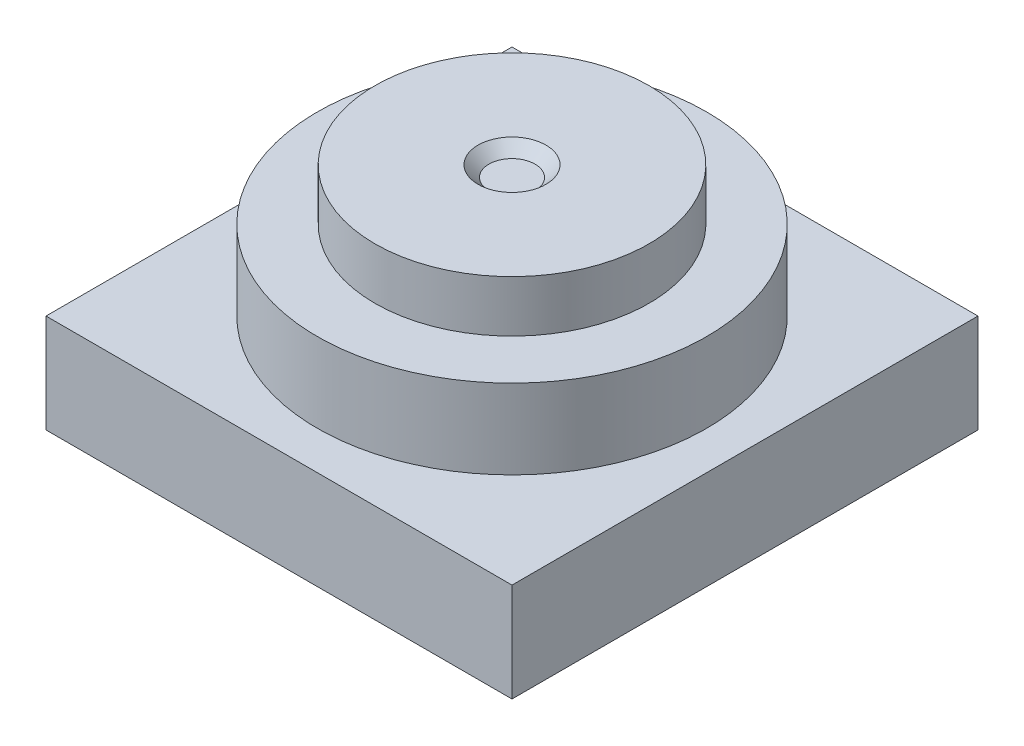
ISO-10303-21;
HEADER;
FILE_DESCRIPTION(('STEP AP214'),'2;1');
FILE_NAME('part.step','',(''),(''),'','','');
FILE_SCHEMA(('AUTOMOTIVE_DESIGN { 1 0 10303 214 1 1 1 1 }'));
ENDSEC;
DATA;
#1=APPLICATION_CONTEXT('core data for automotive mechanical design processes');
#2=APPLICATION_PROTOCOL_DEFINITION('international standard','automotive_design',2000,#1);
#3=PRODUCT_CONTEXT('',#1,'mechanical');
#4=PRODUCT('Part','Part','',(#3));
#5=PRODUCT_RELATED_PRODUCT_CATEGORY('part','',(#4));
#6=PRODUCT_DEFINITION_FORMATION('','',#4);
#7=PRODUCT_DEFINITION_CONTEXT('part definition',#1,'design');
#8=PRODUCT_DEFINITION('design','',#6,#7);
#9=PRODUCT_DEFINITION_SHAPE('','',#8);
#10=(LENGTH_UNIT() NAMED_UNIT(*) SI_UNIT(.MILLI.,.METRE.));
#11=(NAMED_UNIT(*) PLANE_ANGLE_UNIT() SI_UNIT($,.RADIAN.));
#12=(NAMED_UNIT(*) SI_UNIT($,.STERADIAN.) SOLID_ANGLE_UNIT());
#13=UNCERTAINTY_MEASURE_WITH_UNIT(LENGTH_MEASURE(1.E-05),#10,'distance_accuracy_value','');
#14=(GEOMETRIC_REPRESENTATION_CONTEXT(3) GLOBAL_UNCERTAINTY_ASSIGNED_CONTEXT((#13)) GLOBAL_UNIT_ASSIGNED_CONTEXT((#10,
#11,#12)) REPRESENTATION_CONTEXT('',''));
#15=CARTESIAN_POINT('',(0.,0.,0.));
#16=DIRECTION('',(0.,0.,1.));
#17=DIRECTION('',(1.,0.,0.));
#18=AXIS2_PLACEMENT_3D('',#15,#16,#17);
#19=CARTESIAN_POINT('',(4.25,1.8,0.));
#20=DIRECTION('',(1.,0.,0.));
#21=DIRECTION('',(0.,0.,-1.));
#22=AXIS2_PLACEMENT_3D('',#19,#20,#21);
#23=PLANE('',#22);
#24=DIRECTION('',(0.,0.,1.));
#25=VECTOR('',#24,1.);
#26=CARTESIAN_POINT('',(4.25,0.,0.));
#27=LINE('',#26,#25);
#28=CARTESIAN_POINT('',(4.25,0.,-4.25));
#29=VERTEX_POINT('',#28);
#30=CARTESIAN_POINT('',(4.25,0.,4.25));
#31=VERTEX_POINT('',#30);
#32=EDGE_CURVE('E110',#29,#31,#27,.T.);
#33=ORIENTED_EDGE('',*,*,#32,.F.);
#34=DIRECTION('',(0.,-1.,0.));
#35=VECTOR('',#34,1.);
#36=CARTESIAN_POINT('',(4.25,1.8,-4.25));
#37=LINE('',#36,#35);
#38=CARTESIAN_POINT('',(4.25,1.8,-4.25));
#39=VERTEX_POINT('',#38);
#40=EDGE_CURVE('E48',#39,#29,#37,.T.);
#41=ORIENTED_EDGE('',*,*,#40,.F.);
#42=DIRECTION('',(0.,0.,1.));
#43=VECTOR('',#42,1.);
#44=CARTESIAN_POINT('',(4.25,1.8,0.));
#45=LINE('',#44,#43);
#46=CARTESIAN_POINT('',(4.25,1.8,4.25));
#47=VERTEX_POINT('',#46);
#48=EDGE_CURVE('E103',#39,#47,#45,.T.);
#49=ORIENTED_EDGE('',*,*,#48,.T.);
#50=DIRECTION('',(0.,-1.,0.));
#51=VECTOR('',#50,1.);
#52=CARTESIAN_POINT('',(4.25,1.8,4.25));
#53=LINE('',#52,#51);
#54=EDGE_CURVE('E80',#47,#31,#53,.T.);
#55=ORIENTED_EDGE('',*,*,#54,.T.);
#56=EDGE_LOOP('',(#33,#41,#49,#55));
#57=FACE_BOUND('',#56,.T.);
#58=ADVANCED_FACE('F39',(#57),#23,.T.);
#59=CARTESIAN_POINT('',(0.,1.8,-4.25));
#60=DIRECTION('',(0.,0.,-1.));
#61=DIRECTION('',(-1.,0.,0.));
#62=AXIS2_PLACEMENT_3D('',#59,#60,#61);
#63=PLANE('',#62);
#64=DIRECTION('',(1.,0.,0.));
#65=VECTOR('',#64,1.);
#66=CARTESIAN_POINT('',(0.,0.,-4.25));
#67=LINE('',#66,#65);
#68=CARTESIAN_POINT('',(-4.25,0.,-4.25));
#69=VERTEX_POINT('',#68);
#70=EDGE_CURVE('E93',#69,#29,#67,.T.);
#71=ORIENTED_EDGE('',*,*,#70,.F.);
#72=DIRECTION('',(0.,-1.,0.));
#73=VECTOR('',#72,1.);
#74=CARTESIAN_POINT('',(-4.25,1.8,-4.25));
#75=LINE('',#74,#73);
#76=CARTESIAN_POINT('',(-4.25,1.8,-4.25));
#77=VERTEX_POINT('',#76);
#78=EDGE_CURVE('E87',#77,#69,#75,.T.);
#79=ORIENTED_EDGE('',*,*,#78,.F.);
#80=DIRECTION('',(1.,0.,0.));
#81=VECTOR('',#80,1.);
#82=CARTESIAN_POINT('',(0.,1.8,-4.25));
#83=LINE('',#82,#81);
#84=EDGE_CURVE('E91',#77,#39,#83,.T.);
#85=ORIENTED_EDGE('',*,*,#84,.T.);
#86=ORIENTED_EDGE('',*,*,#40,.T.);
#87=EDGE_LOOP('',(#71,#79,#85,#86));
#88=FACE_BOUND('',#87,.T.);
#89=ADVANCED_FACE('F89',(#88),#63,.T.);
#90=CARTESIAN_POINT('',(-4.25,1.8,0.));
#91=DIRECTION('',(1.,0.,0.));
#92=DIRECTION('',(0.,0.,-1.));
#93=AXIS2_PLACEMENT_3D('',#90,#91,#92);
#94=PLANE('',#93);
#95=DIRECTION('',(0.,0.,1.));
#96=VECTOR('',#95,1.);
#97=CARTESIAN_POINT('',(-4.25,0.,0.));
#98=LINE('',#97,#96);
#99=CARTESIAN_POINT('',(-4.25,0.,4.25));
#100=VERTEX_POINT('',#99);
#101=EDGE_CURVE('E114',#69,#100,#98,.T.);
#102=ORIENTED_EDGE('',*,*,#101,.T.);
#103=DIRECTION('',(0.,-1.,0.));
#104=VECTOR('',#103,1.);
#105=CARTESIAN_POINT('',(-4.25,1.8,4.25));
#106=LINE('',#105,#104);
#107=CARTESIAN_POINT('',(-4.25,1.8,4.25));
#108=VERTEX_POINT('',#107);
#109=EDGE_CURVE('E96',#108,#100,#106,.T.);
#110=ORIENTED_EDGE('',*,*,#109,.F.);
#111=DIRECTION('',(0.,0.,1.));
#112=VECTOR('',#111,1.);
#113=CARTESIAN_POINT('',(-4.25,1.8,0.));
#114=LINE('',#113,#112);
#115=EDGE_CURVE('E99',#77,#108,#114,.T.);
#116=ORIENTED_EDGE('',*,*,#115,.F.);
#117=ORIENTED_EDGE('',*,*,#78,.T.);
#118=EDGE_LOOP('',(#102,#110,#116,#117));
#119=FACE_BOUND('',#118,.T.);
#120=ADVANCED_FACE('F100',(#119),#94,.F.);
#121=CARTESIAN_POINT('',(0.,1.8,4.25));
#122=DIRECTION('',(0.,0.,-1.));
#123=DIRECTION('',(-1.,0.,0.));
#124=AXIS2_PLACEMENT_3D('',#121,#122,#123);
#125=PLANE('',#124);
#126=DIRECTION('',(1.,0.,0.));
#127=VECTOR('',#126,1.);
#128=CARTESIAN_POINT('',(0.,0.,4.25));
#129=LINE('',#128,#127);
#130=EDGE_CURVE('E73',#100,#31,#129,.T.);
#131=ORIENTED_EDGE('',*,*,#130,.T.);
#132=ORIENTED_EDGE('',*,*,#54,.F.);
#133=DIRECTION('',(1.,0.,0.));
#134=VECTOR('',#133,1.);
#135=CARTESIAN_POINT('',(0.,1.8,4.25));
#136=LINE('',#135,#134);
#137=EDGE_CURVE('E56',#108,#47,#136,.T.);
#138=ORIENTED_EDGE('',*,*,#137,.F.);
#139=ORIENTED_EDGE('',*,*,#109,.T.);
#140=EDGE_LOOP('',(#131,#132,#138,#139));
#141=FACE_BOUND('',#140,.T.);
#142=ADVANCED_FACE('F129',(#141),#125,.F.);
#143=CARTESIAN_POINT('',(0.,1.8,0.));
#144=DIRECTION('',(0.,1.,0.));
#145=DIRECTION('',(0.,0.,1.));
#146=AXIS2_PLACEMENT_3D('',#143,#144,#145);
#147=PLANE('',#146);
#148=CARTESIAN_POINT('',(0.,1.8,0.));
#149=DIRECTION('',(0.,1.,0.));
#150=DIRECTION('',(0.,0.,1.));
#151=AXIS2_PLACEMENT_3D('',#148,#149,#150);
#152=CIRCLE('',#151,3.55);
#153=CARTESIAN_POINT('',(0.,1.8,-3.55));
#154=VERTEX_POINT('',#153);
#155=EDGE_CURVE('E105',#154,#154,#152,.T.);
#156=ORIENTED_EDGE('',*,*,#155,.F.);
#157=EDGE_LOOP('',(#156));
#158=FACE_BOUND('',#157,.T.);
#159=ORIENTED_EDGE('',*,*,#48,.F.);
#160=ORIENTED_EDGE('',*,*,#84,.F.);
#161=ORIENTED_EDGE('',*,*,#115,.T.);
#162=ORIENTED_EDGE('',*,*,#137,.T.);
#163=EDGE_LOOP('',(#159,#160,#161,#162));
#164=FACE_BOUND('',#163,.T.);
#165=ADVANCED_FACE('F102',(#158,#164),#147,.T.);
#166=CARTESIAN_POINT('',(0.,0.,0.));
#167=DIRECTION('',(0.,1.,0.));
#168=DIRECTION('',(0.,0.,1.));
#169=AXIS2_PLACEMENT_3D('',#166,#167,#168);
#170=PLANE('',#169);
#171=ORIENTED_EDGE('',*,*,#32,.T.);
#172=ORIENTED_EDGE('',*,*,#130,.F.);
#173=ORIENTED_EDGE('',*,*,#101,.F.);
#174=ORIENTED_EDGE('',*,*,#70,.T.);
#175=EDGE_LOOP('',(#171,#172,#173,#174));
#176=FACE_BOUND('',#175,.T.);
#177=ADVANCED_FACE('F118',(#176),#170,.F.);
#178=CARTESIAN_POINT('',(0.,3.25,0.));
#179=DIRECTION('',(0.,-1.,0.));
#180=DIRECTION('',(0.,0.,-1.));
#181=AXIS2_PLACEMENT_3D('',#178,#179,#180);
#182=CYLINDRICAL_SURFACE('',#181,3.55);
#183=CARTESIAN_POINT('',(0.,3.25,0.));
#184=DIRECTION('',(0.,1.,0.));
#185=DIRECTION('',(0.,0.,1.));
#186=AXIS2_PLACEMENT_3D('',#183,#184,#185);
#187=CIRCLE('',#186,3.55);
#188=CARTESIAN_POINT('',(0.,3.25,-3.55));
#189=VERTEX_POINT('',#188);
#190=EDGE_CURVE('E112',#189,#189,#187,.T.);
#191=CARTESIAN_POINT('',(0.,1.8,-3.55));
#192=CARTESIAN_POINT('',(0.,1.81510416666667,-3.55));
#193=CARTESIAN_POINT('',(0.,1.83020833333333,-3.55));
#194=CARTESIAN_POINT('',(0.,1.86041666666667,-3.55));
#195=CARTESIAN_POINT('',(0.,1.87552083333333,-3.55));
#196=CARTESIAN_POINT('',(0.,1.90572916666667,-3.55));
#197=CARTESIAN_POINT('',(0.,1.92083333333333,-3.55));
#198=CARTESIAN_POINT('',(0.,1.95104166666667,-3.55));
#199=CARTESIAN_POINT('',(0.,1.96614583333333,-3.55));
#200=CARTESIAN_POINT('',(0.,1.99635416666667,-3.55));
#201=CARTESIAN_POINT('',(0.,2.01145833333333,-3.55));
#202=CARTESIAN_POINT('',(0.,2.04166666666667,-3.55));
#203=CARTESIAN_POINT('',(0.,2.05677083333333,-3.55));
#204=CARTESIAN_POINT('',(0.,2.08697916666667,-3.55));
#205=CARTESIAN_POINT('',(0.,2.10208333333333,-3.55));
#206=CARTESIAN_POINT('',(0.,2.13229166666667,-3.55));
#207=CARTESIAN_POINT('',(0.,2.14739583333333,-3.55));
#208=CARTESIAN_POINT('',(0.,2.17760416666667,-3.55));
#209=CARTESIAN_POINT('',(0.,2.19270833333333,-3.55));
#210=CARTESIAN_POINT('',(0.,2.22291666666667,-3.55));
#211=CARTESIAN_POINT('',(0.,2.23802083333333,-3.55));
#212=CARTESIAN_POINT('',(0.,2.26822916666667,-3.55));
#213=CARTESIAN_POINT('',(0.,2.28333333333333,-3.55));
#214=CARTESIAN_POINT('',(0.,2.31354166666667,-3.55));
#215=CARTESIAN_POINT('',(0.,2.32864583333333,-3.55));
#216=CARTESIAN_POINT('',(0.,2.35885416666667,-3.55));
#217=CARTESIAN_POINT('',(0.,2.37395833333333,-3.55));
#218=CARTESIAN_POINT('',(0.,2.40416666666667,-3.55));
#219=CARTESIAN_POINT('',(0.,2.41927083333333,-3.55));
#220=CARTESIAN_POINT('',(0.,2.44947916666667,-3.55));
#221=CARTESIAN_POINT('',(0.,2.46458333333333,-3.55));
#222=CARTESIAN_POINT('',(0.,2.49479166666667,-3.55));
#223=CARTESIAN_POINT('',(0.,2.50989583333333,-3.55));
#224=CARTESIAN_POINT('',(0.,2.54010416666667,-3.55));
#225=CARTESIAN_POINT('',(0.,2.55520833333333,-3.55));
#226=CARTESIAN_POINT('',(0.,2.58541666666667,-3.55));
#227=CARTESIAN_POINT('',(0.,2.60052083333333,-3.55));
#228=CARTESIAN_POINT('',(0.,2.63072916666667,-3.55));
#229=CARTESIAN_POINT('',(0.,2.64583333333333,-3.55));
#230=CARTESIAN_POINT('',(0.,2.67604166666667,-3.55));
#231=CARTESIAN_POINT('',(0.,2.69114583333333,-3.55));
#232=CARTESIAN_POINT('',(0.,2.72135416666667,-3.55));
#233=CARTESIAN_POINT('',(0.,2.73645833333333,-3.55));
#234=CARTESIAN_POINT('',(0.,2.76666666666667,-3.55));
#235=CARTESIAN_POINT('',(0.,2.78177083333333,-3.55));
#236=CARTESIAN_POINT('',(0.,2.81197916666667,-3.55));
#237=CARTESIAN_POINT('',(0.,2.82708333333333,-3.55));
#238=CARTESIAN_POINT('',(0.,2.85729166666667,-3.55));
#239=CARTESIAN_POINT('',(0.,2.87239583333333,-3.55));
#240=CARTESIAN_POINT('',(0.,2.90260416666667,-3.55));
#241=CARTESIAN_POINT('',(0.,2.91770833333333,-3.55));
#242=CARTESIAN_POINT('',(0.,2.94791666666667,-3.55));
#243=CARTESIAN_POINT('',(0.,2.96302083333333,-3.55));
#244=CARTESIAN_POINT('',(0.,2.99322916666667,-3.55));
#245=CARTESIAN_POINT('',(0.,3.00833333333333,-3.55));
#246=CARTESIAN_POINT('',(0.,3.03854166666667,-3.55));
#247=CARTESIAN_POINT('',(0.,3.05364583333333,-3.55));
#248=CARTESIAN_POINT('',(0.,3.08385416666667,-3.55));
#249=CARTESIAN_POINT('',(0.,3.09895833333333,-3.55));
#250=CARTESIAN_POINT('',(0.,3.12916666666667,-3.55));
#251=CARTESIAN_POINT('',(0.,3.14427083333333,-3.55));
#252=CARTESIAN_POINT('',(0.,3.17447916666667,-3.55));
#253=CARTESIAN_POINT('',(0.,3.18958333333333,-3.55));
#254=CARTESIAN_POINT('',(0.,3.21979166666667,-3.55));
#255=CARTESIAN_POINT('',(0.,3.23489583333333,-3.55));
#256=CARTESIAN_POINT('',(0.,3.25,-3.55));
#257=B_SPLINE_CURVE_WITH_KNOTS('',3,(#191,#192,#193,#194,#195,#196,#197,#198,#199,#200,#201,
#202,#203,#204,#205,#206,#207,#208,#209,#210,#211,#212,#213,#214,#215,#216,#217,#218,#219,#220,
#221,#222,#223,#224,#225,#226,#227,#228,#229,#230,#231,#232,#233,#234,#235,#236,#237,#238,#239,
#240,#241,#242,#243,#244,#245,#246,#247,#248,#249,#250,#251,#252,#253,#254,#255,#256),
.UNSPECIFIED.,.F.,.F.,(4,2,2,2,2,2,2,2,2,2,2,2,2,2,2,2,2,2,2,2,2,2,2,2,2,2,2,2,2,2,2,2,4),(0.,
0.0453125,0.090625,0.1359375,0.18125,0.2265625,0.271875,0.3171875,0.3625,0.4078125,0.453125,
0.4984375,0.54375,0.5890625,0.634375,0.6796875,0.725,0.7703125,0.815625,0.8609375,0.90625,
0.9515625,0.996875,1.0421875,1.0875,1.1328125,1.178125,1.2234375,1.26875,1.3140625,1.359375,
1.4046875,1.45),.UNSPECIFIED.);
#258=EDGE_CURVE('BSEAM120',#154,#189,#257,.T.);
#259=ORIENTED_EDGE('',*,*,#155,.T.);
#260=ORIENTED_EDGE('',*,*,#190,.F.);
#261=ORIENTED_EDGE('',*,*,#258,.T.);
#262=ORIENTED_EDGE('',*,*,#258,.F.);
#263=EDGE_LOOP('',(#259,#261,#260,#262));
#264=FACE_BOUND('',#263,.T.);
#265=ADVANCED_FACE('F120',(#264),#182,.T.);
#266=CARTESIAN_POINT('',(0.,3.25,0.));
#267=DIRECTION('',(0.,1.,0.));
#268=DIRECTION('',(0.,0.,1.));
#269=AXIS2_PLACEMENT_3D('',#266,#267,#268);
#270=PLANE('',#269);
#271=CARTESIAN_POINT('',(0.,3.25,0.));
#272=DIRECTION('',(0.,1.,0.));
#273=DIRECTION('',(0.,0.,1.));
#274=AXIS2_PLACEMENT_3D('',#271,#272,#273);
#275=CIRCLE('',#274,2.5);
#276=CARTESIAN_POINT('',(0.,3.25,2.5));
#277=VERTEX_POINT('',#276);
#278=EDGE_CURVE('E187',#277,#277,#275,.T.);
#279=ORIENTED_EDGE('',*,*,#278,.F.);
#280=EDGE_LOOP('',(#279));
#281=FACE_BOUND('',#280,.T.);
#282=ORIENTED_EDGE('',*,*,#190,.T.);
#283=EDGE_LOOP('',(#282));
#284=FACE_BOUND('',#283,.T.);
#285=ADVANCED_FACE('F126',(#281,#284),#270,.T.);
#286=CARTESIAN_POINT('',(0.,4.19,0.));
#287=DIRECTION('',(0.,1.,0.));
#288=DIRECTION('',(0.,0.,1.));
#289=AXIS2_PLACEMENT_3D('',#286,#287,#288);
#290=PLANE('',#289);
#291=CARTESIAN_POINT('',(0.,4.19,0.));
#292=DIRECTION('',(0.,1.,0.));
#293=DIRECTION('',(0.,0.,1.));
#294=AXIS2_PLACEMENT_3D('',#291,#292,#293);
#295=CIRCLE('',#294,0.620000000000001);
#296=CARTESIAN_POINT('',(0.,4.19,0.620000000000001));
#297=VERTEX_POINT('',#296);
#298=EDGE_CURVE('E11',#297,#297,#295,.F.);
#299=ORIENTED_EDGE('',*,*,#298,.T.);
#300=EDGE_LOOP('',(#299));
#301=FACE_BOUND('',#300,.T.);
#302=CARTESIAN_POINT('',(0.,4.19,0.));
#303=DIRECTION('',(0.,1.,0.));
#304=DIRECTION('',(0.,0.,1.));
#305=AXIS2_PLACEMENT_3D('',#302,#303,#304);
#306=CIRCLE('',#305,2.5);
#307=CARTESIAN_POINT('',(0.,4.19,2.5));
#308=VERTEX_POINT('',#307);
#309=EDGE_CURVE('E184',#308,#308,#306,.T.);
#310=ORIENTED_EDGE('',*,*,#309,.T.);
#311=EDGE_LOOP('',(#310));
#312=FACE_BOUND('',#311,.T.);
#313=ADVANCED_FACE('F199',(#301,#312),#290,.T.);
#314=CARTESIAN_POINT('',(0.,4.19,0.));
#315=DIRECTION('',(0.,-1.,0.));
#316=DIRECTION('',(0.,0.,-1.));
#317=AXIS2_PLACEMENT_3D('',#314,#315,#316);
#318=CYLINDRICAL_SURFACE('',#317,2.5);
#319=ORIENTED_EDGE('',*,*,#278,.T.);
#320=EDGE_LOOP('',(#319));
#321=FACE_BOUND('',#320,.T.);
#322=ORIENTED_EDGE('',*,*,#309,.F.);
#323=EDGE_LOOP('',(#322));
#324=FACE_BOUND('',#323,.T.);
#325=ADVANCED_FACE('F165',(#321,#324),#318,.T.);
#326=CARTESIAN_POINT('',(0.,3.99,0.));
#327=DIRECTION('',(0.,1.,0.));
#328=DIRECTION('',(0.,0.,1.));
#329=AXIS2_PLACEMENT_3D('',#326,#327,#328);
#330=PLANE('',#329);
#331=CARTESIAN_POINT('',(0.,3.99,0.));
#332=DIRECTION('',(0.,1.,0.));
#333=DIRECTION('',(0.,0.,1.));
#334=AXIS2_PLACEMENT_3D('',#331,#332,#333);
#335=CIRCLE('',#334,0.42);
#336=CARTESIAN_POINT('',(0.,3.99,0.42));
#337=VERTEX_POINT('',#336);
#338=EDGE_CURVE('E183',#337,#337,#335,.T.);
#339=ORIENTED_EDGE('',*,*,#338,.T.);
#340=EDGE_LOOP('',(#339));
#341=FACE_BOUND('',#340,.T.);
#342=ADVANCED_FACE('F161',(#341),#330,.T.);
#343=CARTESIAN_POINT('',(0.,3.99,0.));
#344=DIRECTION('',(0.,1.,0.));
#345=DIRECTION('',(0.,0.,1.));
#346=AXIS2_PLACEMENT_3D('',#343,#344,#345);
#347=CONICAL_SURFACE('',#346,0.42,0.785398163397447);
#348=ORIENTED_EDGE('',*,*,#298,.F.);
#349=EDGE_LOOP('',(#348));
#350=FACE_BOUND('',#349,.T.);
#351=ORIENTED_EDGE('',*,*,#338,.F.);
#352=EDGE_LOOP('',(#351));
#353=FACE_BOUND('',#352,.T.);
#354=ADVANCED_FACE('F41',(#350,#353),#347,.F.);
#355=CLOSED_SHELL('',(#58,#89,#120,#142,#165,#177,#265,#285,#313,#325,#342,#354));
#356=MANIFOLD_SOLID_BREP('B2',#355);
#357=ADVANCED_BREP_SHAPE_REPRESENTATION('',(#18,#356),#14);
#358=SHAPE_DEFINITION_REPRESENTATION(#9,#357);
ENDSEC;
END-ISO-10303-21;
